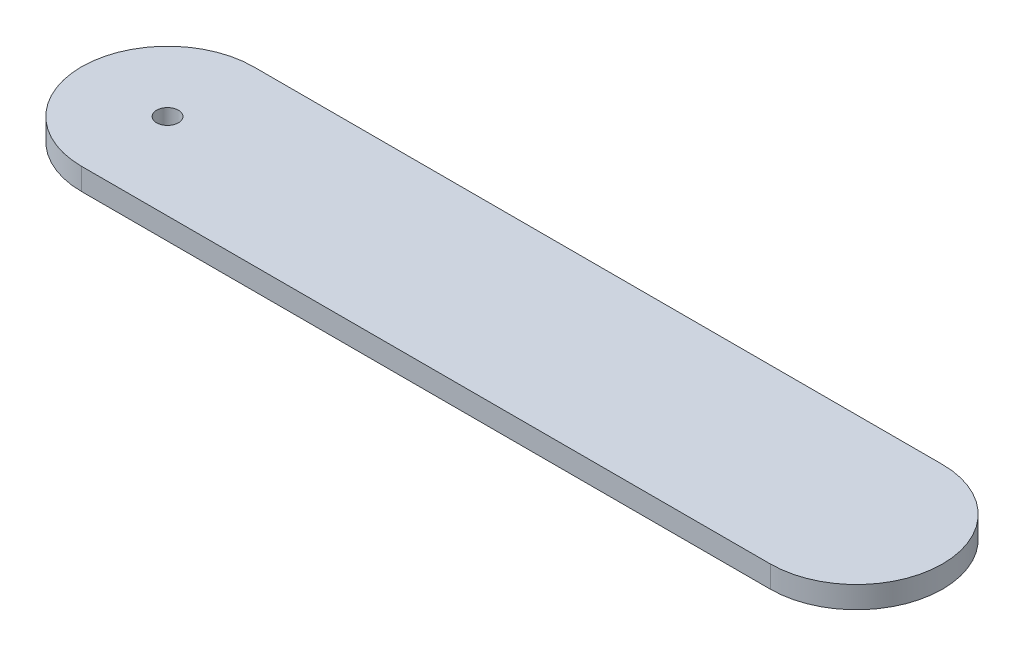
ISO-10303-21;
HEADER;
FILE_DESCRIPTION(('STEP AP214'),'2;1');
FILE_NAME('part.step','',(''),(''),'','','');
FILE_SCHEMA(('AUTOMOTIVE_DESIGN { 1 0 10303 214 1 1 1 1 }'));
ENDSEC;
DATA;
#1=APPLICATION_CONTEXT('core data for automotive mechanical design processes');
#2=APPLICATION_PROTOCOL_DEFINITION('international standard','automotive_design',2000,#1);
#3=PRODUCT_CONTEXT('',#1,'mechanical');
#4=PRODUCT('Part','Part','',(#3));
#5=PRODUCT_RELATED_PRODUCT_CATEGORY('part','',(#4));
#6=PRODUCT_DEFINITION_FORMATION('','',#4);
#7=PRODUCT_DEFINITION_CONTEXT('part definition',#1,'design');
#8=PRODUCT_DEFINITION('design','',#6,#7);
#9=PRODUCT_DEFINITION_SHAPE('','',#8);
#10=(LENGTH_UNIT() NAMED_UNIT(*) SI_UNIT(.MILLI.,.METRE.));
#11=(NAMED_UNIT(*) PLANE_ANGLE_UNIT() SI_UNIT($,.RADIAN.));
#12=(NAMED_UNIT(*) SI_UNIT($,.STERADIAN.) SOLID_ANGLE_UNIT());
#13=UNCERTAINTY_MEASURE_WITH_UNIT(LENGTH_MEASURE(1.E-05),#10,'distance_accuracy_value','');
#14=(GEOMETRIC_REPRESENTATION_CONTEXT(3) GLOBAL_UNCERTAINTY_ASSIGNED_CONTEXT((#13)) GLOBAL_UNIT_ASSIGNED_CONTEXT((#10,
#11,#12)) REPRESENTATION_CONTEXT('',''));
#15=CARTESIAN_POINT('',(0.,0.,0.));
#16=DIRECTION('',(0.,0.,1.));
#17=DIRECTION('',(1.,0.,0.));
#18=AXIS2_PLACEMENT_3D('',#15,#16,#17);
#19=CARTESIAN_POINT('',(0.,6.35,0.));
#20=DIRECTION('',(0.,-1.,0.));
#21=DIRECTION('',(0.,0.,-1.));
#22=AXIS2_PLACEMENT_3D('',#19,#20,#21);
#23=CYLINDRICAL_SURFACE('',#22,25.);
#24=CARTESIAN_POINT('',(0.,0.,0.));
#25=DIRECTION('',(0.,1.,0.));
#26=DIRECTION('',(0.,0.,1.));
#27=AXIS2_PLACEMENT_3D('',#24,#25,#26);
#28=CIRCLE('',#27,25.);
#29=CARTESIAN_POINT('',(0.,0.,-25.));
#30=VERTEX_POINT('',#29);
#31=CARTESIAN_POINT('',(0.,0.,25.));
#32=VERTEX_POINT('',#31);
#33=EDGE_CURVE('E96',#30,#32,#28,.T.);
#34=ORIENTED_EDGE('',*,*,#33,.T.);
#35=DIRECTION('',(0.,-1.,0.));
#36=VECTOR('',#35,1.);
#37=CARTESIAN_POINT('',(0.,6.35,25.));
#38=LINE('',#37,#36);
#39=CARTESIAN_POINT('',(0.,6.35,25.));
#40=VERTEX_POINT('',#39);
#41=EDGE_CURVE('E11',#40,#32,#38,.T.);
#42=ORIENTED_EDGE('',*,*,#41,.F.);
#43=CARTESIAN_POINT('',(0.,6.35,0.));
#44=DIRECTION('',(0.,1.,0.));
#45=DIRECTION('',(0.,0.,1.));
#46=AXIS2_PLACEMENT_3D('',#43,#44,#45);
#47=CIRCLE('',#46,25.);
#48=CARTESIAN_POINT('',(0.,6.35,-25.));
#49=VERTEX_POINT('',#48);
#50=EDGE_CURVE('E84',#49,#40,#47,.T.);
#51=ORIENTED_EDGE('',*,*,#50,.F.);
#52=DIRECTION('',(0.,-1.,0.));
#53=VECTOR('',#52,1.);
#54=CARTESIAN_POINT('',(0.,6.35,-25.));
#55=LINE('',#54,#53);
#56=EDGE_CURVE('E92',#49,#30,#55,.T.);
#57=ORIENTED_EDGE('',*,*,#56,.T.);
#58=EDGE_LOOP('',(#34,#42,#51,#57));
#59=FACE_BOUND('',#58,.T.);
#60=ADVANCED_FACE('F33',(#59),#23,.T.);
#61=CARTESIAN_POINT('',(0.,6.35,25.));
#62=DIRECTION('',(0.,0.,-1.));
#63=DIRECTION('',(-1.,0.,0.));
#64=AXIS2_PLACEMENT_3D('',#61,#62,#63);
#65=PLANE('',#64);
#66=DIRECTION('',(1.,0.,0.));
#67=VECTOR('',#66,1.);
#68=CARTESIAN_POINT('',(0.,0.,25.));
#69=LINE('',#68,#67);
#70=CARTESIAN_POINT('',(200.,0.,25.));
#71=VERTEX_POINT('',#70);
#72=EDGE_CURVE('E88',#32,#71,#69,.T.);
#73=ORIENTED_EDGE('',*,*,#72,.T.);
#74=DIRECTION('',(0.,-1.,0.));
#75=VECTOR('',#74,1.);
#76=CARTESIAN_POINT('',(200.,6.35,25.));
#77=LINE('',#76,#75);
#78=CARTESIAN_POINT('',(200.,6.35,25.));
#79=VERTEX_POINT('',#78);
#80=EDGE_CURVE('E41',#79,#71,#77,.T.);
#81=ORIENTED_EDGE('',*,*,#80,.F.);
#82=DIRECTION('',(1.,0.,0.));
#83=VECTOR('',#82,1.);
#84=CARTESIAN_POINT('',(0.,6.35,25.));
#85=LINE('',#84,#83);
#86=EDGE_CURVE('E79',#40,#79,#85,.T.);
#87=ORIENTED_EDGE('',*,*,#86,.F.);
#88=ORIENTED_EDGE('',*,*,#41,.T.);
#89=EDGE_LOOP('',(#73,#81,#87,#88));
#90=FACE_BOUND('',#89,.T.);
#91=ADVANCED_FACE('F87',(#90),#65,.F.);
#92=CARTESIAN_POINT('',(200.,6.35,0.));
#93=DIRECTION('',(0.,-1.,0.));
#94=DIRECTION('',(0.,0.,-1.));
#95=AXIS2_PLACEMENT_3D('',#92,#93,#94);
#96=CYLINDRICAL_SURFACE('',#95,25.);
#97=CARTESIAN_POINT('',(200.,0.,0.));
#98=DIRECTION('',(0.,1.,0.));
#99=DIRECTION('',(0.,0.,1.));
#100=AXIS2_PLACEMENT_3D('',#97,#98,#99);
#101=CIRCLE('',#100,25.);
#102=CARTESIAN_POINT('',(200.,0.,-25.));
#103=VERTEX_POINT('',#102);
#104=EDGE_CURVE('E66',#71,#103,#101,.T.);
#105=ORIENTED_EDGE('',*,*,#104,.T.);
#106=DIRECTION('',(0.,-1.,0.));
#107=VECTOR('',#106,1.);
#108=CARTESIAN_POINT('',(200.,6.35,-25.));
#109=LINE('',#108,#107);
#110=CARTESIAN_POINT('',(200.,6.35,-25.));
#111=VERTEX_POINT('',#110);
#112=EDGE_CURVE('E89',#111,#103,#109,.T.);
#113=ORIENTED_EDGE('',*,*,#112,.F.);
#114=CARTESIAN_POINT('',(200.,6.35,0.));
#115=DIRECTION('',(0.,1.,0.));
#116=DIRECTION('',(0.,0.,1.));
#117=AXIS2_PLACEMENT_3D('',#114,#115,#116);
#118=CIRCLE('',#117,25.);
#119=EDGE_CURVE('E82',#79,#111,#118,.T.);
#120=ORIENTED_EDGE('',*,*,#119,.F.);
#121=ORIENTED_EDGE('',*,*,#80,.T.);
#122=EDGE_LOOP('',(#105,#113,#120,#121));
#123=FACE_BOUND('',#122,.T.);
#124=ADVANCED_FACE('F90',(#123),#96,.T.);
#125=CARTESIAN_POINT('',(0.,6.35,-25.));
#126=DIRECTION('',(0.,0.,1.));
#127=DIRECTION('',(1.,0.,0.));
#128=AXIS2_PLACEMENT_3D('',#125,#126,#127);
#129=PLANE('',#128);
#130=DIRECTION('',(-1.,0.,0.));
#131=VECTOR('',#130,1.);
#132=CARTESIAN_POINT('',(0.,0.,-25.));
#133=LINE('',#132,#131);
#134=EDGE_CURVE('E72',#103,#30,#133,.T.);
#135=ORIENTED_EDGE('',*,*,#134,.T.);
#136=ORIENTED_EDGE('',*,*,#56,.F.);
#137=DIRECTION('',(-1.,0.,0.));
#138=VECTOR('',#137,1.);
#139=CARTESIAN_POINT('',(0.,6.35,-25.));
#140=LINE('',#139,#138);
#141=EDGE_CURVE('E49',#111,#49,#140,.T.);
#142=ORIENTED_EDGE('',*,*,#141,.F.);
#143=ORIENTED_EDGE('',*,*,#112,.T.);
#144=EDGE_LOOP('',(#135,#136,#142,#143));
#145=FACE_BOUND('',#144,.T.);
#146=ADVANCED_FACE('F104',(#145),#129,.F.);
#147=CARTESIAN_POINT('',(0.,6.35,0.));
#148=DIRECTION('',(0.,1.,0.));
#149=DIRECTION('',(0.,0.,1.));
#150=AXIS2_PLACEMENT_3D('',#147,#148,#149);
#151=PLANE('',#150);
#152=CARTESIAN_POINT('',(0.,6.35,0.));
#153=DIRECTION('',(0.,1.,0.));
#154=DIRECTION('',(0.,0.,1.));
#155=AXIS2_PLACEMENT_3D('',#152,#153,#154);
#156=CIRCLE('',#155,3.175);
#157=CARTESIAN_POINT('',(0.,6.35,3.175));
#158=VERTEX_POINT('',#157);
#159=EDGE_CURVE('E110',#158,#158,#156,.T.);
#160=ORIENTED_EDGE('',*,*,#159,.F.);
#161=EDGE_LOOP('',(#160));
#162=FACE_BOUND('',#161,.T.);
#163=ORIENTED_EDGE('',*,*,#50,.T.);
#164=ORIENTED_EDGE('',*,*,#86,.T.);
#165=ORIENTED_EDGE('',*,*,#119,.T.);
#166=ORIENTED_EDGE('',*,*,#141,.T.);
#167=EDGE_LOOP('',(#163,#164,#165,#166));
#168=FACE_BOUND('',#167,.T.);
#169=ADVANCED_FACE('F80',(#162,#168),#151,.T.);
#170=CARTESIAN_POINT('',(0.,0.,0.));
#171=DIRECTION('',(0.,1.,0.));
#172=DIRECTION('',(0.,0.,1.));
#173=AXIS2_PLACEMENT_3D('',#170,#171,#172);
#174=PLANE('',#173);
#175=CARTESIAN_POINT('',(0.,0.,0.));
#176=DIRECTION('',(0.,1.,0.));
#177=DIRECTION('',(0.,0.,1.));
#178=AXIS2_PLACEMENT_3D('',#175,#176,#177);
#179=CIRCLE('',#178,3.175);
#180=CARTESIAN_POINT('',(0.,0.,3.175));
#181=VERTEX_POINT('',#180);
#182=EDGE_CURVE('E99',#181,#181,#179,.T.);
#183=ORIENTED_EDGE('',*,*,#182,.T.);
#184=EDGE_LOOP('',(#183));
#185=FACE_BOUND('',#184,.T.);
#186=ORIENTED_EDGE('',*,*,#33,.F.);
#187=ORIENTED_EDGE('',*,*,#134,.F.);
#188=ORIENTED_EDGE('',*,*,#104,.F.);
#189=ORIENTED_EDGE('',*,*,#72,.F.);
#190=EDGE_LOOP('',(#186,#187,#188,#189));
#191=FACE_BOUND('',#190,.T.);
#192=ADVANCED_FACE('F107',(#185,#191),#174,.F.);
#193=CARTESIAN_POINT('',(0.,0.,0.));
#194=DIRECTION('',(0.,1.,0.));
#195=DIRECTION('',(0.,0.,1.));
#196=AXIS2_PLACEMENT_3D('',#193,#194,#195);
#197=CYLINDRICAL_SURFACE('',#196,3.175);
#198=ORIENTED_EDGE('',*,*,#182,.F.);
#199=EDGE_LOOP('',(#198));
#200=FACE_BOUND('',#199,.T.);
#201=ORIENTED_EDGE('',*,*,#159,.T.);
#202=EDGE_LOOP('',(#201));
#203=FACE_BOUND('',#202,.T.);
#204=ADVANCED_FACE('F117',(#200,#203),#197,.F.);
#205=CLOSED_SHELL('',(#60,#91,#124,#146,#169,#192,#204));
#206=MANIFOLD_SOLID_BREP('B2',#205);
#207=ADVANCED_BREP_SHAPE_REPRESENTATION('',(#18,#206),#14);
#208=SHAPE_DEFINITION_REPRESENTATION(#9,#207);
ENDSEC;
END-ISO-10303-21;
